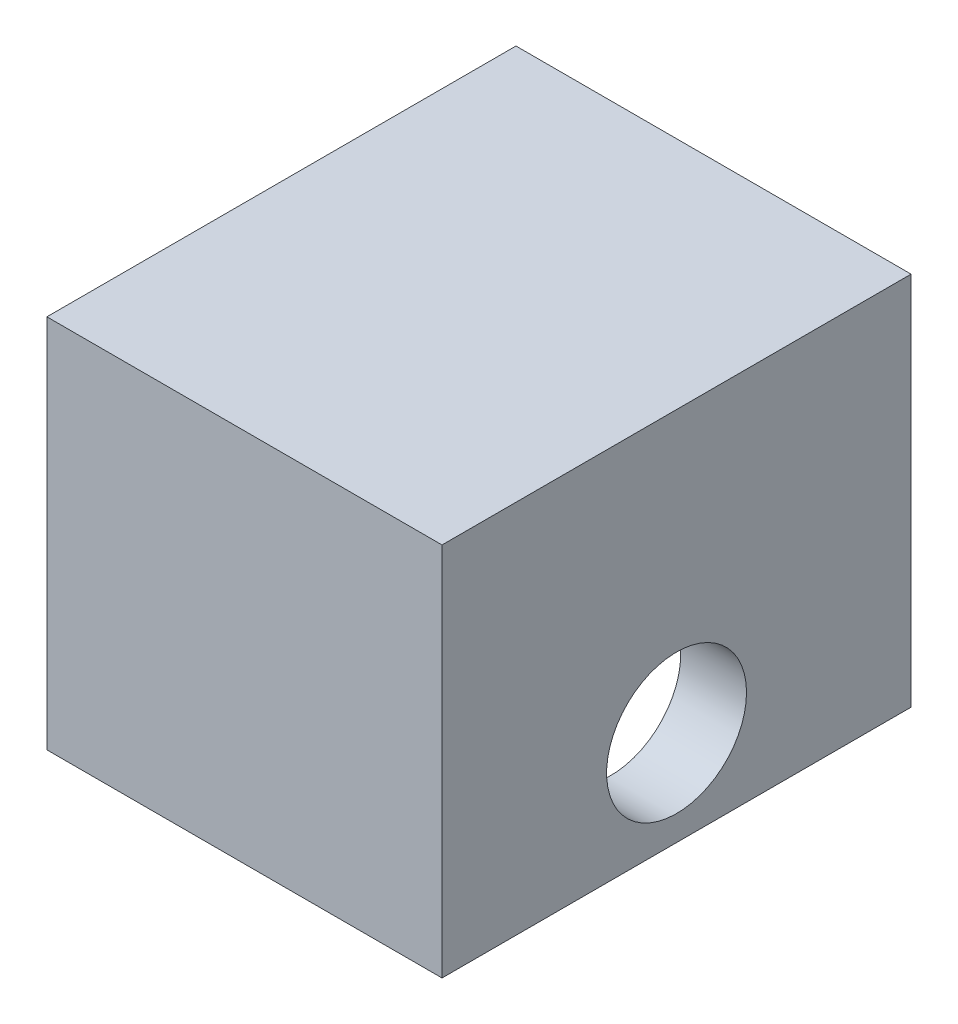
ISO-10303-21;
HEADER;
FILE_DESCRIPTION(('STEP AP214'),'2;1');
FILE_NAME('part.step','',(''),(''),'','','');
FILE_SCHEMA(('AUTOMOTIVE_DESIGN { 1 0 10303 214 1 1 1 1 }'));
ENDSEC;
DATA;
#1=APPLICATION_CONTEXT('core data for automotive mechanical design processes');
#2=APPLICATION_PROTOCOL_DEFINITION('international standard','automotive_design',2000,#1);
#3=PRODUCT_CONTEXT('',#1,'mechanical');
#4=PRODUCT('Part','Part','',(#3));
#5=PRODUCT_RELATED_PRODUCT_CATEGORY('part','',(#4));
#6=PRODUCT_DEFINITION_FORMATION('','',#4);
#7=PRODUCT_DEFINITION_CONTEXT('part definition',#1,'design');
#8=PRODUCT_DEFINITION('design','',#6,#7);
#9=PRODUCT_DEFINITION_SHAPE('','',#8);
#10=(LENGTH_UNIT() NAMED_UNIT(*) SI_UNIT(.MILLI.,.METRE.));
#11=(NAMED_UNIT(*) PLANE_ANGLE_UNIT() SI_UNIT($,.RADIAN.));
#12=(NAMED_UNIT(*) SI_UNIT($,.STERADIAN.) SOLID_ANGLE_UNIT());
#13=UNCERTAINTY_MEASURE_WITH_UNIT(LENGTH_MEASURE(1.E-05),#10,'distance_accuracy_value','');
#14=(GEOMETRIC_REPRESENTATION_CONTEXT(3) GLOBAL_UNCERTAINTY_ASSIGNED_CONTEXT((#13)) GLOBAL_UNIT_ASSIGNED_CONTEXT((#10,
#11,#12)) REPRESENTATION_CONTEXT('',''));
#15=CARTESIAN_POINT('',(0.,0.,0.));
#16=DIRECTION('',(0.,0.,1.));
#17=DIRECTION('',(1.,0.,0.));
#18=AXIS2_PLACEMENT_3D('',#15,#16,#17);
#19=CARTESIAN_POINT('',(0.,0.,10.24636));
#20=DIRECTION('',(-1.,0.,0.));
#21=DIRECTION('',(0.,0.,1.));
#22=AXIS2_PLACEMENT_3D('',#19,#20,#21);
#23=PLANE('',#22);
#24=CARTESIAN_POINT('',(0.,3.58648,5.12318));
#25=DIRECTION('',(-1.,0.,0.));
#26=DIRECTION('',(0.,0.,1.));
#27=AXIS2_PLACEMENT_3D('',#24,#25,#26);
#28=CIRCLE('',#27,2.12471);
#29=CARTESIAN_POINT('',(0.,3.58648,7.24789));
#30=VERTEX_POINT('',#29);
#31=EDGE_CURVE('E163',#30,#30,#28,.T.);
#32=ORIENTED_EDGE('',*,*,#31,.T.);
#33=EDGE_LOOP('',(#32));
#34=FACE_BOUND('',#33,.T.);
#35=DIRECTION('',(0.,1.,0.));
#36=VECTOR('',#35,1.);
#37=CARTESIAN_POINT('',(0.,0.,10.24636));
#38=LINE('',#37,#36);
#39=CARTESIAN_POINT('',(0.,0.6985,10.24636));
#40=VERTEX_POINT('',#39);
#41=CARTESIAN_POINT('',(0.,10.08888,10.24636));
#42=VERTEX_POINT('',#41);
#43=EDGE_CURVE('E167',#40,#42,#38,.T.);
#44=ORIENTED_EDGE('',*,*,#43,.F.);
#45=DIRECTION('',(0.,0.,-1.));
#46=VECTOR('',#45,1.);
#47=CARTESIAN_POINT('',(0.,0.6985,10.24636));
#48=LINE('',#47,#46);
#49=CARTESIAN_POINT('',(0.,0.6985,0.));
#50=VERTEX_POINT('',#49);
#51=EDGE_CURVE('E151',#40,#50,#48,.T.);
#52=ORIENTED_EDGE('',*,*,#51,.T.);
#53=DIRECTION('',(0.,1.,0.));
#54=VECTOR('',#53,1.);
#55=CARTESIAN_POINT('',(0.,0.,0.));
#56=LINE('',#55,#54);
#57=CARTESIAN_POINT('',(0.,10.08888,0.));
#58=VERTEX_POINT('',#57);
#59=EDGE_CURVE('E166',#50,#58,#56,.T.);
#60=ORIENTED_EDGE('',*,*,#59,.T.);
#61=DIRECTION('',(0.,0.,-1.));
#62=VECTOR('',#61,1.);
#63=CARTESIAN_POINT('',(0.,10.08888,10.24636));
#64=LINE('',#63,#62);
#65=EDGE_CURVE('E13',#42,#58,#64,.T.);
#66=ORIENTED_EDGE('',*,*,#65,.F.);
#67=EDGE_LOOP('',(#44,#52,#60,#66));
#68=FACE_BOUND('',#67,.T.);
#69=ADVANCED_FACE('F45',(#34,#68),#23,.F.);
#70=CARTESIAN_POINT('',(0.,10.08888,10.24636));
#71=DIRECTION('',(0.,1.,0.));
#72=DIRECTION('',(0.,0.,1.));
#73=AXIS2_PLACEMENT_3D('',#70,#71,#72);
#74=PLANE('',#73);
#75=DIRECTION('',(1.,0.,0.));
#76=VECTOR('',#75,1.);
#77=CARTESIAN_POINT('',(0.,10.08888,0.));
#78=LINE('',#77,#76);
#79=CARTESIAN_POINT('',(8.001,10.08888,0.));
#80=VERTEX_POINT('',#79);
#81=EDGE_CURVE('E179',#58,#80,#78,.T.);
#82=ORIENTED_EDGE('',*,*,#81,.T.);
#83=DIRECTION('',(0.,0.,-1.));
#84=VECTOR('',#83,1.);
#85=CARTESIAN_POINT('',(8.001,10.08888,10.24636));
#86=LINE('',#85,#84);
#87=CARTESIAN_POINT('',(8.001,10.08888,10.24636));
#88=VERTEX_POINT('',#87);
#89=EDGE_CURVE('E53',#88,#80,#86,.T.);
#90=ORIENTED_EDGE('',*,*,#89,.F.);
#91=DIRECTION('',(1.,0.,0.));
#92=VECTOR('',#91,1.);
#93=CARTESIAN_POINT('',(0.,10.08888,10.24636));
#94=LINE('',#93,#92);
#95=EDGE_CURVE('E170',#42,#88,#94,.T.);
#96=ORIENTED_EDGE('',*,*,#95,.F.);
#97=ORIENTED_EDGE('',*,*,#65,.T.);
#98=EDGE_LOOP('',(#82,#90,#96,#97));
#99=FACE_BOUND('',#98,.T.);
#100=ADVANCED_FACE('F192',(#99),#74,.F.);
#101=CARTESIAN_POINT('',(8.001,10.08888,10.24636));
#102=DIRECTION('',(1.,0.,0.));
#103=DIRECTION('',(0.,0.,-1.));
#104=AXIS2_PLACEMENT_3D('',#101,#102,#103);
#105=PLANE('',#104);
#106=CARTESIAN_POINT('',(8.001,3.58648,5.12318));
#107=DIRECTION('',(1.,0.,0.));
#108=DIRECTION('',(0.,0.,-1.));
#109=AXIS2_PLACEMENT_3D('',#106,#107,#108);
#110=CIRCLE('',#109,2.12471);
#111=CARTESIAN_POINT('',(8.001,3.58648,2.99847));
#112=VERTEX_POINT('',#111);
#113=EDGE_CURVE('E158',#112,#112,#110,.T.);
#114=ORIENTED_EDGE('',*,*,#113,.T.);
#115=EDGE_LOOP('',(#114));
#116=FACE_BOUND('',#115,.T.);
#117=DIRECTION('',(0.,-1.,0.));
#118=VECTOR('',#117,1.);
#119=CARTESIAN_POINT('',(8.001,10.08888,0.));
#120=LINE('',#119,#118);
#121=CARTESIAN_POINT('',(8.001,0.6985,0.));
#122=VERTEX_POINT('',#121);
#123=EDGE_CURVE('E171',#80,#122,#120,.T.);
#124=ORIENTED_EDGE('',*,*,#123,.T.);
#125=DIRECTION('',(0.,0.,1.));
#126=VECTOR('',#125,1.);
#127=CARTESIAN_POINT('',(8.001,0.698499999999999,10.24636));
#128=LINE('',#127,#126);
#129=CARTESIAN_POINT('',(8.001,0.6985,10.24636));
#130=VERTEX_POINT('',#129);
#131=EDGE_CURVE('E116',#122,#130,#128,.T.);
#132=ORIENTED_EDGE('',*,*,#131,.T.);
#133=DIRECTION('',(0.,-1.,0.));
#134=VECTOR('',#133,1.);
#135=CARTESIAN_POINT('',(8.001,10.08888,10.24636));
#136=LINE('',#135,#134);
#137=EDGE_CURVE('E174',#88,#130,#136,.T.);
#138=ORIENTED_EDGE('',*,*,#137,.F.);
#139=ORIENTED_EDGE('',*,*,#89,.T.);
#140=EDGE_LOOP('',(#124,#132,#138,#139));
#141=FACE_BOUND('',#140,.T.);
#142=ADVANCED_FACE('F186',(#116,#141),#105,.F.);
#143=CARTESIAN_POINT('',(9.99998,0.,10.24636));
#144=DIRECTION('',(-1.,0.,0.));
#145=DIRECTION('',(0.,0.,1.));
#146=AXIS2_PLACEMENT_3D('',#143,#144,#145);
#147=PLANE('',#146);
#148=CARTESIAN_POINT('',(9.99998,3.58648,5.12318));
#149=DIRECTION('',(1.,0.,0.));
#150=DIRECTION('',(0.,0.,-1.));
#151=AXIS2_PLACEMENT_3D('',#148,#149,#150);
#152=CIRCLE('',#151,2.12471);
#153=CARTESIAN_POINT('',(9.99998,3.58648,2.99847));
#154=VERTEX_POINT('',#153);
#155=EDGE_CURVE('E154',#154,#154,#152,.T.);
#156=ORIENTED_EDGE('',*,*,#155,.F.);
#157=EDGE_LOOP('',(#156));
#158=FACE_BOUND('',#157,.T.);
#159=DIRECTION('',(0.,0.,-1.));
#160=VECTOR('',#159,1.);
#161=CARTESIAN_POINT('',(9.99998,12.08786,10.24636));
#162=LINE('',#161,#160);
#163=CARTESIAN_POINT('',(9.99998,12.08786,12.24534));
#164=VERTEX_POINT('',#163);
#165=CARTESIAN_POINT('',(9.99998,12.08786,-1.99898));
#166=VERTEX_POINT('',#165);
#167=EDGE_CURVE('E184',#164,#166,#162,.T.);
#168=ORIENTED_EDGE('',*,*,#167,.F.);
#169=DIRECTION('',(0.,-1.,0.));
#170=VECTOR('',#169,1.);
#171=CARTESIAN_POINT('',(9.99998,12.08786,12.24534));
#172=LINE('',#171,#170);
#173=CARTESIAN_POINT('',(9.99998,0.6985,12.24534));
#174=VERTEX_POINT('',#173);
#175=EDGE_CURVE('E136',#164,#174,#172,.T.);
#176=ORIENTED_EDGE('',*,*,#175,.T.);
#177=DIRECTION('',(0.,0.,1.));
#178=VECTOR('',#177,1.);
#179=CARTESIAN_POINT('',(9.99998,0.6985,10.24636));
#180=LINE('',#179,#178);
#181=CARTESIAN_POINT('',(9.99998,0.6985,-1.99898));
#182=VERTEX_POINT('',#181);
#183=EDGE_CURVE('E117',#182,#174,#180,.T.);
#184=ORIENTED_EDGE('',*,*,#183,.F.);
#185=DIRECTION('',(0.,1.,0.));
#186=VECTOR('',#185,1.);
#187=CARTESIAN_POINT('',(9.99998,12.08786,-1.99898));
#188=LINE('',#187,#186);
#189=EDGE_CURVE('E125',#182,#166,#188,.T.);
#190=ORIENTED_EDGE('',*,*,#189,.T.);
#191=EDGE_LOOP('',(#168,#176,#184,#190));
#192=FACE_BOUND('',#191,.T.);
#193=ADVANCED_FACE('F231',(#158,#192),#147,.F.);
#194=CARTESIAN_POINT('',(9.99998,12.08786,10.24636));
#195=DIRECTION('',(0.,-1.,0.));
#196=DIRECTION('',(0.,0.,-1.));
#197=AXIS2_PLACEMENT_3D('',#194,#195,#196);
#198=PLANE('',#197);
#199=ORIENTED_EDGE('',*,*,#167,.T.);
#200=DIRECTION('',(1.,0.,0.));
#201=VECTOR('',#200,1.);
#202=CARTESIAN_POINT('',(-1.99898,12.08786,-1.99898));
#203=LINE('',#202,#201);
#204=CARTESIAN_POINT('',(-1.99898,12.08786,-1.99898));
#205=VERTEX_POINT('',#204);
#206=EDGE_CURVE('E126',#205,#166,#203,.T.);
#207=ORIENTED_EDGE('',*,*,#206,.F.);
#208=DIRECTION('',(0.,0.,-1.));
#209=VECTOR('',#208,1.);
#210=CARTESIAN_POINT('',(-1.99898,12.08786,10.24636));
#211=LINE('',#210,#209);
#212=CARTESIAN_POINT('',(-1.99898,12.08786,12.24534));
#213=VERTEX_POINT('',#212);
#214=EDGE_CURVE('E130',#213,#205,#211,.T.);
#215=ORIENTED_EDGE('',*,*,#214,.F.);
#216=DIRECTION('',(1.,0.,0.));
#217=VECTOR('',#216,1.);
#218=CARTESIAN_POINT('',(-1.99898,12.08786,12.24534));
#219=LINE('',#218,#217);
#220=EDGE_CURVE('E140',#213,#164,#219,.T.);
#221=ORIENTED_EDGE('',*,*,#220,.T.);
#222=EDGE_LOOP('',(#199,#207,#215,#221));
#223=FACE_BOUND('',#222,.T.);
#224=ADVANCED_FACE('F224',(#223),#198,.F.);
#225=CARTESIAN_POINT('',(-1.99898,12.08786,10.24636));
#226=DIRECTION('',(1.,0.,0.));
#227=DIRECTION('',(0.,0.,-1.));
#228=AXIS2_PLACEMENT_3D('',#225,#226,#227);
#229=PLANE('',#228);
#230=CARTESIAN_POINT('',(-1.99898,3.58648,5.12318));
#231=DIRECTION('',(1.,0.,0.));
#232=DIRECTION('',(0.,0.,-1.));
#233=AXIS2_PLACEMENT_3D('',#230,#231,#232);
#234=CIRCLE('',#233,2.12471);
#235=CARTESIAN_POINT('',(-1.99898,3.58648,2.99847));
#236=VERTEX_POINT('',#235);
#237=EDGE_CURVE('E155',#236,#236,#234,.T.);
#238=ORIENTED_EDGE('',*,*,#237,.T.);
#239=EDGE_LOOP('',(#238));
#240=FACE_BOUND('',#239,.T.);
#241=ORIENTED_EDGE('',*,*,#214,.T.);
#242=DIRECTION('',(0.,1.,0.));
#243=VECTOR('',#242,1.);
#244=CARTESIAN_POINT('',(-1.99898,12.08786,-1.99898));
#245=LINE('',#244,#243);
#246=CARTESIAN_POINT('',(-1.99898,0.6985,-1.99898));
#247=VERTEX_POINT('',#246);
#248=EDGE_CURVE('E123',#247,#205,#245,.T.);
#249=ORIENTED_EDGE('',*,*,#248,.F.);
#250=DIRECTION('',(0.,0.,1.));
#251=VECTOR('',#250,1.);
#252=CARTESIAN_POINT('',(-1.99898,0.6985,10.24636));
#253=LINE('',#252,#251);
#254=CARTESIAN_POINT('',(-1.99898,0.6985,12.24534));
#255=VERTEX_POINT('',#254);
#256=EDGE_CURVE('E105',#247,#255,#253,.T.);
#257=ORIENTED_EDGE('',*,*,#256,.T.);
#258=DIRECTION('',(0.,-1.,0.));
#259=VECTOR('',#258,1.);
#260=CARTESIAN_POINT('',(-1.99898,12.08786,12.24534));
#261=LINE('',#260,#259);
#262=EDGE_CURVE('E138',#213,#255,#261,.T.);
#263=ORIENTED_EDGE('',*,*,#262,.F.);
#264=EDGE_LOOP('',(#241,#249,#257,#263));
#265=FACE_BOUND('',#264,.T.);
#266=ADVANCED_FACE('F129',(#240,#265),#229,.F.);
#267=CARTESIAN_POINT('',(-1.99898,3.58648,5.12318));
#268=DIRECTION('',(1.,0.,0.));
#269=DIRECTION('',(0.,0.,-1.));
#270=AXIS2_PLACEMENT_3D('',#267,#268,#269);
#271=CYLINDRICAL_SURFACE('',#270,2.12471);
#272=ORIENTED_EDGE('',*,*,#237,.F.);
#273=EDGE_LOOP('',(#272));
#274=FACE_BOUND('',#273,.T.);
#275=ORIENTED_EDGE('',*,*,#31,.F.);
#276=EDGE_LOOP('',(#275));
#277=FACE_BOUND('',#276,.T.);
#278=ADVANCED_FACE('F208',(#274,#277),#271,.F.);
#279=ORIENTED_EDGE('',*,*,#155,.T.);
#280=EDGE_LOOP('',(#279));
#281=FACE_BOUND('',#280,.T.);
#282=ORIENTED_EDGE('',*,*,#113,.F.);
#283=EDGE_LOOP('',(#282));
#284=FACE_BOUND('',#283,.T.);
#285=ADVANCED_FACE('F200',(#281,#284),#271,.F.);
#286=CARTESIAN_POINT('',(-1.99898,0.6985,10.24636));
#287=DIRECTION('',(0.,1.,0.));
#288=DIRECTION('',(0.,0.,1.));
#289=AXIS2_PLACEMENT_3D('',#286,#287,#288);
#290=PLANE('',#289);
#291=ORIENTED_EDGE('',*,*,#131,.F.);
#292=DIRECTION('',(1.,0.,0.));
#293=VECTOR('',#292,1.);
#294=CARTESIAN_POINT('',(-1.99898,0.6985,0.));
#295=LINE('',#294,#293);
#296=EDGE_CURVE('E127',#50,#122,#295,.T.);
#297=ORIENTED_EDGE('',*,*,#296,.F.);
#298=ORIENTED_EDGE('',*,*,#51,.F.);
#299=DIRECTION('',(1.,0.,0.));
#300=VECTOR('',#299,1.);
#301=CARTESIAN_POINT('',(-1.99898,0.6985,10.24636));
#302=LINE('',#301,#300);
#303=EDGE_CURVE('E143',#40,#130,#302,.T.);
#304=ORIENTED_EDGE('',*,*,#303,.T.);
#305=EDGE_LOOP('',(#291,#297,#298,#304));
#306=FACE_BOUND('',#305,.T.);
#307=DIRECTION('',(1.,0.,0.));
#308=VECTOR('',#307,1.);
#309=CARTESIAN_POINT('',(-1.99898,0.6985,-1.99898));
#310=LINE('',#309,#308);
#311=EDGE_CURVE('E108',#247,#182,#310,.T.);
#312=ORIENTED_EDGE('',*,*,#311,.T.);
#313=ORIENTED_EDGE('',*,*,#183,.T.);
#314=DIRECTION('',(1.,0.,0.));
#315=VECTOR('',#314,1.);
#316=CARTESIAN_POINT('',(-1.99898,0.6985,12.24534));
#317=LINE('',#316,#315);
#318=EDGE_CURVE('E111',#255,#174,#317,.T.);
#319=ORIENTED_EDGE('',*,*,#318,.F.);
#320=ORIENTED_EDGE('',*,*,#256,.F.);
#321=EDGE_LOOP('',(#312,#313,#319,#320));
#322=FACE_BOUND('',#321,.T.);
#323=ADVANCED_FACE('F107',(#306,#322),#290,.F.);
#324=CARTESIAN_POINT('',(-1.99898,0.6985,10.24636));
#325=DIRECTION('',(0.,0.,-1.));
#326=DIRECTION('',(-1.,0.,0.));
#327=AXIS2_PLACEMENT_3D('',#324,#325,#326);
#328=PLANE('',#327);
#329=ORIENTED_EDGE('',*,*,#303,.F.);
#330=ORIENTED_EDGE('',*,*,#43,.T.);
#331=ORIENTED_EDGE('',*,*,#95,.T.);
#332=ORIENTED_EDGE('',*,*,#137,.T.);
#333=EDGE_LOOP('',(#329,#330,#331,#332));
#334=FACE_BOUND('',#333,.T.);
#335=ADVANCED_FACE('F190',(#334),#328,.T.);
#336=CARTESIAN_POINT('',(-1.99898,12.08786,12.24534));
#337=DIRECTION('',(0.,0.,1.));
#338=DIRECTION('',(0.,-1.,0.));
#339=AXIS2_PLACEMENT_3D('',#336,#337,#338);
#340=PLANE('',#339);
#341=ORIENTED_EDGE('',*,*,#175,.F.);
#342=ORIENTED_EDGE('',*,*,#220,.F.);
#343=ORIENTED_EDGE('',*,*,#262,.T.);
#344=ORIENTED_EDGE('',*,*,#318,.T.);
#345=EDGE_LOOP('',(#341,#342,#343,#344));
#346=FACE_BOUND('',#345,.T.);
#347=ADVANCED_FACE('F206',(#346),#340,.T.);
#348=CARTESIAN_POINT('',(-1.99898,12.08786,0.));
#349=DIRECTION('',(0.,0.,1.));
#350=DIRECTION('',(1.,0.,0.));
#351=AXIS2_PLACEMENT_3D('',#348,#349,#350);
#352=PLANE('',#351);
#353=ORIENTED_EDGE('',*,*,#123,.F.);
#354=ORIENTED_EDGE('',*,*,#81,.F.);
#355=ORIENTED_EDGE('',*,*,#59,.F.);
#356=ORIENTED_EDGE('',*,*,#296,.T.);
#357=EDGE_LOOP('',(#353,#354,#355,#356));
#358=FACE_BOUND('',#357,.T.);
#359=ADVANCED_FACE('F197',(#358),#352,.T.);
#360=CARTESIAN_POINT('',(-1.99898,12.08786,-1.99898));
#361=DIRECTION('',(0.,0.,-1.));
#362=DIRECTION('',(0.,1.,0.));
#363=AXIS2_PLACEMENT_3D('',#360,#361,#362);
#364=PLANE('',#363);
#365=ORIENTED_EDGE('',*,*,#189,.F.);
#366=ORIENTED_EDGE('',*,*,#311,.F.);
#367=ORIENTED_EDGE('',*,*,#248,.T.);
#368=ORIENTED_EDGE('',*,*,#206,.T.);
#369=EDGE_LOOP('',(#365,#366,#367,#368));
#370=FACE_BOUND('',#369,.T.);
#371=ADVANCED_FACE('F121',(#370),#364,.T.);
#372=CLOSED_SHELL('',(#69,#100,#142,#193,#224,#266,#278,#285,#323,#335,#347,#359,#371));
#373=MANIFOLD_SOLID_BREP('B2',#372);
#374=ADVANCED_BREP_SHAPE_REPRESENTATION('',(#18,#373),#14);
#375=SHAPE_DEFINITION_REPRESENTATION(#9,#374);
ENDSEC;
END-ISO-10303-21;
